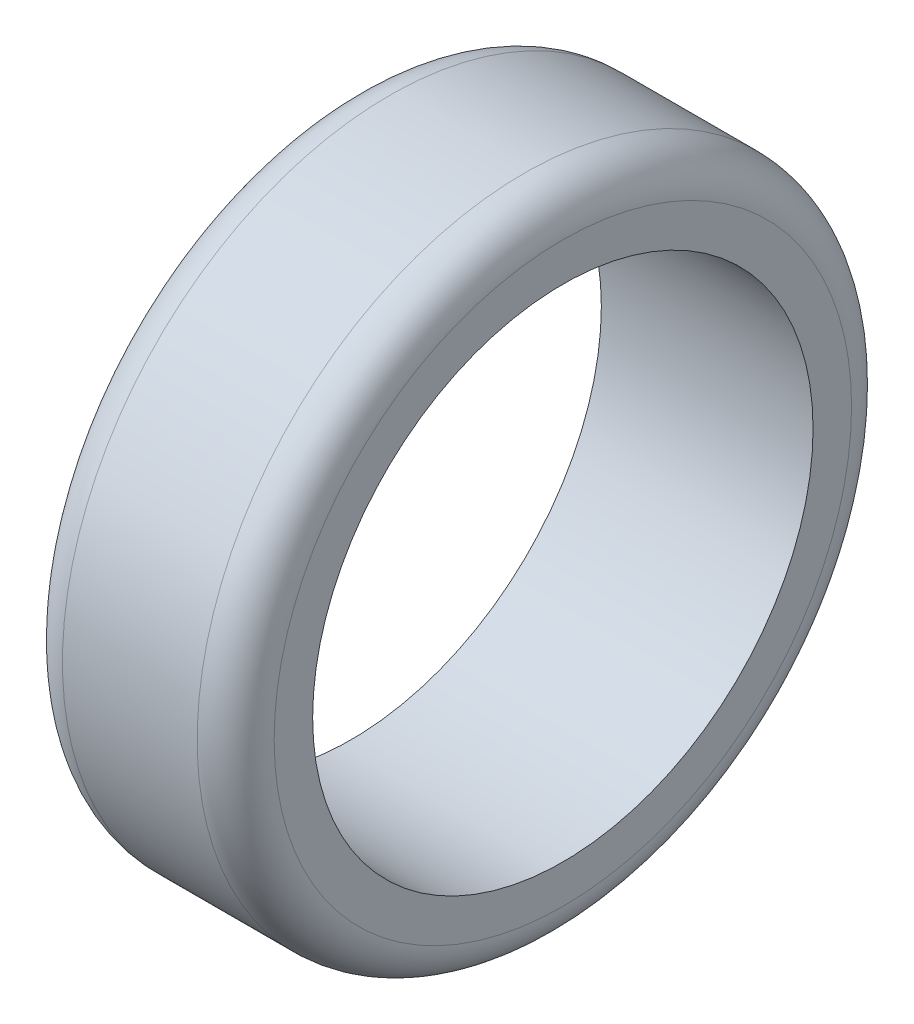
ISO-10303-21;
HEADER;
FILE_DESCRIPTION(('STEP AP214'),'2;1');
FILE_NAME('part.step','',(''),(''),'','','');
FILE_SCHEMA(('AUTOMOTIVE_DESIGN { 1 0 10303 214 1 1 1 1 }'));
ENDSEC;
DATA;
#1=APPLICATION_CONTEXT('core data for automotive mechanical design processes');
#2=APPLICATION_PROTOCOL_DEFINITION('international standard','automotive_design',2000,#1);
#3=PRODUCT_CONTEXT('',#1,'mechanical');
#4=PRODUCT('Part','Part','',(#3));
#5=PRODUCT_RELATED_PRODUCT_CATEGORY('part','',(#4));
#6=PRODUCT_DEFINITION_FORMATION('','',#4);
#7=PRODUCT_DEFINITION_CONTEXT('part definition',#1,'design');
#8=PRODUCT_DEFINITION('design','',#6,#7);
#9=PRODUCT_DEFINITION_SHAPE('','',#8);
#10=(LENGTH_UNIT() NAMED_UNIT(*) SI_UNIT(.MILLI.,.METRE.));
#11=(NAMED_UNIT(*) PLANE_ANGLE_UNIT() SI_UNIT($,.RADIAN.));
#12=(NAMED_UNIT(*) SI_UNIT($,.STERADIAN.) SOLID_ANGLE_UNIT());
#13=UNCERTAINTY_MEASURE_WITH_UNIT(LENGTH_MEASURE(1.E-05),#10,'distance_accuracy_value','');
#14=(GEOMETRIC_REPRESENTATION_CONTEXT(3) GLOBAL_UNCERTAINTY_ASSIGNED_CONTEXT((#13)) GLOBAL_UNIT_ASSIGNED_CONTEXT((#10,
#11,#12)) REPRESENTATION_CONTEXT('',''));
#15=CARTESIAN_POINT('',(0.,0.,0.));
#16=DIRECTION('',(0.,0.,1.));
#17=DIRECTION('',(1.,0.,0.));
#18=AXIS2_PLACEMENT_3D('',#15,#16,#17);
#19=CARTESIAN_POINT('',(22.,0.,0.));
#20=DIRECTION('',(-1.,0.,0.));
#21=DIRECTION('',(0.,0.,1.));
#22=AXIS2_PLACEMENT_3D('',#19,#20,#21);
#23=CYLINDRICAL_SURFACE('',#22,34.);
#24=CARTESIAN_POINT('',(18.,0.,0.));
#25=DIRECTION('',(1.,0.,0.));
#26=DIRECTION('',(0.,0.,-1.));
#27=AXIS2_PLACEMENT_3D('',#24,#25,#26);
#28=CIRCLE('',#27,34.);
#29=CARTESIAN_POINT('',(18.,0.,-34.));
#30=VERTEX_POINT('',#29);
#31=EDGE_CURVE('E48',#30,#30,#28,.F.);
#32=ORIENTED_EDGE('',*,*,#31,.T.);
#33=EDGE_LOOP('',(#32));
#34=FACE_BOUND('',#33,.T.);
#35=CARTESIAN_POINT('',(4.,0.,0.));
#36=DIRECTION('',(1.,0.,0.));
#37=DIRECTION('',(0.,0.,-1.));
#38=AXIS2_PLACEMENT_3D('',#35,#36,#37);
#39=CIRCLE('',#38,34.);
#40=CARTESIAN_POINT('',(4.,0.,-34.));
#41=VERTEX_POINT('',#40);
#42=EDGE_CURVE('E53',#41,#41,#39,.T.);
#43=ORIENTED_EDGE('',*,*,#42,.T.);
#44=EDGE_LOOP('',(#43));
#45=FACE_BOUND('',#44,.T.);
#46=ADVANCED_FACE('F40',(#34,#45),#23,.T.);
#47=CARTESIAN_POINT('',(22.,0.,0.));
#48=DIRECTION('',(1.,0.,0.));
#49=DIRECTION('',(0.,0.,-1.));
#50=AXIS2_PLACEMENT_3D('',#47,#48,#49);
#51=PLANE('',#50);
#52=CARTESIAN_POINT('',(22.,0.,0.));
#53=DIRECTION('',(1.,0.,0.));
#54=DIRECTION('',(0.,0.,-1.));
#55=AXIS2_PLACEMENT_3D('',#52,#53,#54);
#56=CIRCLE('',#55,30.);
#57=CARTESIAN_POINT('',(22.,0.,-30.));
#58=VERTEX_POINT('',#57);
#59=EDGE_CURVE('E58',#58,#58,#56,.T.);
#60=ORIENTED_EDGE('',*,*,#59,.T.);
#61=EDGE_LOOP('',(#60));
#62=FACE_BOUND('',#61,.T.);
#63=CARTESIAN_POINT('',(22.,0.,0.));
#64=DIRECTION('',(-1.,0.,0.));
#65=DIRECTION('',(0.,0.,1.));
#66=AXIS2_PLACEMENT_3D('',#63,#64,#65);
#67=CIRCLE('',#66,26.);
#68=CARTESIAN_POINT('',(22.,0.,26.));
#69=VERTEX_POINT('',#68);
#70=EDGE_CURVE('E64',#69,#69,#67,.T.);
#71=ORIENTED_EDGE('',*,*,#70,.T.);
#72=EDGE_LOOP('',(#71));
#73=FACE_BOUND('',#72,.T.);
#74=ADVANCED_FACE('F73',(#62,#73),#51,.T.);
#75=CARTESIAN_POINT('',(0.,0.,0.));
#76=DIRECTION('',(1.,0.,0.));
#77=DIRECTION('',(0.,0.,-1.));
#78=AXIS2_PLACEMENT_3D('',#75,#76,#77);
#79=PLANE('',#78);
#80=CARTESIAN_POINT('',(0.,0.,0.));
#81=DIRECTION('',(1.,0.,0.));
#82=DIRECTION('',(0.,0.,-1.));
#83=AXIS2_PLACEMENT_3D('',#80,#81,#82);
#84=CIRCLE('',#83,30.);
#85=CARTESIAN_POINT('',(0.,0.,-30.));
#86=VERTEX_POINT('',#85);
#87=EDGE_CURVE('E10',#86,#86,#84,.F.);
#88=ORIENTED_EDGE('',*,*,#87,.T.);
#89=EDGE_LOOP('',(#88));
#90=FACE_BOUND('',#89,.T.);
#91=CARTESIAN_POINT('',(0.,0.,0.));
#92=DIRECTION('',(-1.,0.,0.));
#93=DIRECTION('',(0.,0.,1.));
#94=AXIS2_PLACEMENT_3D('',#91,#92,#93);
#95=CIRCLE('',#94,26.);
#96=CARTESIAN_POINT('',(0.,0.,26.));
#97=VERTEX_POINT('',#96);
#98=EDGE_CURVE('E65',#97,#97,#95,.T.);
#99=ORIENTED_EDGE('',*,*,#98,.F.);
#100=EDGE_LOOP('',(#99));
#101=FACE_BOUND('',#100,.T.);
#102=ADVANCED_FACE('F79',(#90,#101),#79,.F.);
#103=CARTESIAN_POINT('',(22.,0.,0.));
#104=DIRECTION('',(-1.,0.,0.));
#105=DIRECTION('',(0.,0.,1.));
#106=AXIS2_PLACEMENT_3D('',#103,#104,#105);
#107=CYLINDRICAL_SURFACE('',#106,26.);
#108=ORIENTED_EDGE('',*,*,#70,.F.);
#109=EDGE_LOOP('',(#108));
#110=FACE_BOUND('',#109,.T.);
#111=ORIENTED_EDGE('',*,*,#98,.T.);
#112=EDGE_LOOP('',(#111));
#113=FACE_BOUND('',#112,.T.);
#114=ADVANCED_FACE('F75',(#110,#113),#107,.F.);
#115=CARTESIAN_POINT('',(18.,0.,0.));
#116=DIRECTION('',(1.,0.,0.));
#117=DIRECTION('',(0.,0.,-1.));
#118=AXIS2_PLACEMENT_3D('',#115,#116,#117);
#119=TOROIDAL_SURFACE('',#118,30.,4.);
#120=ORIENTED_EDGE('',*,*,#31,.F.);
#121=EDGE_LOOP('',(#120));
#122=FACE_BOUND('',#121,.T.);
#123=ORIENTED_EDGE('',*,*,#59,.F.);
#124=EDGE_LOOP('',(#123));
#125=FACE_BOUND('',#124,.T.);
#126=ADVANCED_FACE('F78',(#122,#125),#119,.T.);
#127=CARTESIAN_POINT('',(4.,0.,0.));
#128=DIRECTION('',(1.,0.,0.));
#129=DIRECTION('',(0.,0.,-1.));
#130=AXIS2_PLACEMENT_3D('',#127,#128,#129);
#131=TOROIDAL_SURFACE('',#130,30.,4.);
#132=ORIENTED_EDGE('',*,*,#87,.F.);
#133=EDGE_LOOP('',(#132));
#134=FACE_BOUND('',#133,.T.);
#135=ORIENTED_EDGE('',*,*,#42,.F.);
#136=EDGE_LOOP('',(#135));
#137=FACE_BOUND('',#136,.T.);
#138=ADVANCED_FACE('F42',(#134,#137),#131,.T.);
#139=CLOSED_SHELL('',(#46,#74,#102,#114,#126,#138));
#140=MANIFOLD_SOLID_BREP('B2',#139);
#141=ADVANCED_BREP_SHAPE_REPRESENTATION('',(#18,#140),#14);
#142=SHAPE_DEFINITION_REPRESENTATION(#9,#141);
ENDSEC;
END-ISO-10303-21;
